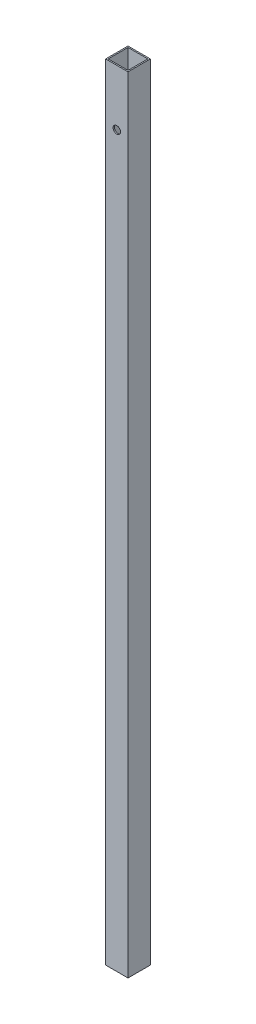
ISO-10303-21;
HEADER;
FILE_DESCRIPTION(('STEP AP214'),'2;1');
FILE_NAME('part.step','',(''),(''),'','','');
FILE_SCHEMA(('AUTOMOTIVE_DESIGN { 1 0 10303 214 1 1 1 1 }'));
ENDSEC;
DATA;
#1=APPLICATION_CONTEXT('core data for automotive mechanical design processes');
#2=APPLICATION_PROTOCOL_DEFINITION('international standard','automotive_design',2000,#1);
#3=PRODUCT_CONTEXT('',#1,'mechanical');
#4=PRODUCT('Part','Part','',(#3));
#5=PRODUCT_RELATED_PRODUCT_CATEGORY('part','',(#4));
#6=PRODUCT_DEFINITION_FORMATION('','',#4);
#7=PRODUCT_DEFINITION_CONTEXT('part definition',#1,'design');
#8=PRODUCT_DEFINITION('design','',#6,#7);
#9=PRODUCT_DEFINITION_SHAPE('','',#8);
#10=(LENGTH_UNIT() NAMED_UNIT(*) SI_UNIT(.MILLI.,.METRE.));
#11=(NAMED_UNIT(*) PLANE_ANGLE_UNIT() SI_UNIT($,.RADIAN.));
#12=(NAMED_UNIT(*) SI_UNIT($,.STERADIAN.) SOLID_ANGLE_UNIT());
#13=UNCERTAINTY_MEASURE_WITH_UNIT(LENGTH_MEASURE(1.E-05),#10,'distance_accuracy_value','');
#14=(GEOMETRIC_REPRESENTATION_CONTEXT(3) GLOBAL_UNCERTAINTY_ASSIGNED_CONTEXT((#13)) GLOBAL_UNIT_ASSIGNED_CONTEXT((#10,
#11,#12)) REPRESENTATION_CONTEXT('',''));
#15=CARTESIAN_POINT('',(0.,0.,0.));
#16=DIRECTION('',(0.,0.,1.));
#17=DIRECTION('',(1.,0.,0.));
#18=AXIS2_PLACEMENT_3D('',#15,#16,#17);
#19=CARTESIAN_POINT('',(0.,632.,0.));
#20=DIRECTION('',(0.,1.,0.));
#21=DIRECTION('',(0.,0.,1.));
#22=AXIS2_PLACEMENT_3D('',#19,#20,#21);
#23=PLANE('',#22);
#24=DIRECTION('',(0.,0.,-1.));
#25=VECTOR('',#24,1.);
#26=CARTESIAN_POINT('',(9.00000000000001,632.,-9.));
#27=LINE('',#26,#25);
#28=CARTESIAN_POINT('',(9.00000000000001,632.,9.00000000000001));
#29=VERTEX_POINT('',#28);
#30=CARTESIAN_POINT('',(9.00000000000001,632.,-9.));
#31=VERTEX_POINT('',#30);
#32=EDGE_CURVE('E143',#29,#31,#27,.T.);
#33=ORIENTED_EDGE('',*,*,#32,.T.);
#34=DIRECTION('',(-1.,0.,0.));
#35=VECTOR('',#34,1.);
#36=CARTESIAN_POINT('',(-9.,632.,-9.));
#37=LINE('',#36,#35);
#38=CARTESIAN_POINT('',(-9.,632.,-9.));
#39=VERTEX_POINT('',#38);
#40=EDGE_CURVE('E146',#31,#39,#37,.T.);
#41=ORIENTED_EDGE('',*,*,#40,.T.);
#42=DIRECTION('',(0.,0.,1.));
#43=VECTOR('',#42,1.);
#44=CARTESIAN_POINT('',(-9.,632.,-9.));
#45=LINE('',#44,#43);
#46=CARTESIAN_POINT('',(-8.99999999999999,632.,9.00000000000001));
#47=VERTEX_POINT('',#46);
#48=EDGE_CURVE('E149',#39,#47,#45,.T.);
#49=ORIENTED_EDGE('',*,*,#48,.T.);
#50=DIRECTION('',(1.,0.,0.));
#51=VECTOR('',#50,1.);
#52=CARTESIAN_POINT('',(-8.99999999999999,632.,9.00000000000001));
#53=LINE('',#52,#51);
#54=EDGE_CURVE('E151',#47,#29,#53,.T.);
#55=ORIENTED_EDGE('',*,*,#54,.T.);
#56=EDGE_LOOP('',(#33,#41,#49,#55));
#57=FACE_BOUND('',#56,.T.);
#58=DIRECTION('',(0.,0.,1.));
#59=VECTOR('',#58,1.);
#60=CARTESIAN_POINT('',(-8.,632.,-8.));
#61=LINE('',#60,#59);
#62=CARTESIAN_POINT('',(-8.,632.,-8.));
#63=VERTEX_POINT('',#62);
#64=CARTESIAN_POINT('',(-7.99999999999999,632.,8.00000000000001));
#65=VERTEX_POINT('',#64);
#66=EDGE_CURVE('E113',#63,#65,#61,.T.);
#67=ORIENTED_EDGE('',*,*,#66,.F.);
#68=DIRECTION('',(-1.,0.,0.));
#69=VECTOR('',#68,1.);
#70=CARTESIAN_POINT('',(-8.,632.,-8.));
#71=LINE('',#70,#69);
#72=CARTESIAN_POINT('',(8.,632.,-8.));
#73=VERTEX_POINT('',#72);
#74=EDGE_CURVE('E105',#73,#63,#71,.T.);
#75=ORIENTED_EDGE('',*,*,#74,.F.);
#76=DIRECTION('',(0.,0.,-1.));
#77=VECTOR('',#76,1.);
#78=CARTESIAN_POINT('',(8.,632.,-8.));
#79=LINE('',#78,#77);
#80=CARTESIAN_POINT('',(8.00000000000001,632.,8.00000000000001));
#81=VERTEX_POINT('',#80);
#82=EDGE_CURVE('E127',#81,#73,#79,.T.);
#83=ORIENTED_EDGE('',*,*,#82,.F.);
#84=DIRECTION('',(1.,0.,0.));
#85=VECTOR('',#84,1.);
#86=CARTESIAN_POINT('',(-7.99999999999999,632.,8.00000000000001));
#87=LINE('',#86,#85);
#88=EDGE_CURVE('E125',#65,#81,#87,.T.);
#89=ORIENTED_EDGE('',*,*,#88,.F.);
#90=EDGE_LOOP('',(#67,#75,#83,#89));
#91=FACE_BOUND('',#90,.T.);
#92=ADVANCED_FACE('F39',(#57,#91),#23,.T.);
#93=CARTESIAN_POINT('',(0.,0.,0.));
#94=DIRECTION('',(0.,1.,0.));
#95=DIRECTION('',(0.,0.,1.));
#96=AXIS2_PLACEMENT_3D('',#93,#94,#95);
#97=PLANE('',#96);
#98=DIRECTION('',(0.,0.,-1.));
#99=VECTOR('',#98,1.);
#100=CARTESIAN_POINT('',(9.00000000000001,0.,-9.));
#101=LINE('',#100,#99);
#102=CARTESIAN_POINT('',(9.00000000000001,0.,9.00000000000001));
#103=VERTEX_POINT('',#102);
#104=CARTESIAN_POINT('',(9.00000000000001,0.,-9.));
#105=VERTEX_POINT('',#104);
#106=EDGE_CURVE('E121',#103,#105,#101,.T.);
#107=ORIENTED_EDGE('',*,*,#106,.F.);
#108=DIRECTION('',(1.,0.,0.));
#109=VECTOR('',#108,1.);
#110=CARTESIAN_POINT('',(-8.99999999999999,0.,9.00000000000001));
#111=LINE('',#110,#109);
#112=CARTESIAN_POINT('',(-8.99999999999999,0.,9.00000000000001));
#113=VERTEX_POINT('',#112);
#114=EDGE_CURVE('E147',#113,#103,#111,.T.);
#115=ORIENTED_EDGE('',*,*,#114,.F.);
#116=DIRECTION('',(0.,0.,1.));
#117=VECTOR('',#116,1.);
#118=CARTESIAN_POINT('',(-9.,0.,-9.));
#119=LINE('',#118,#117);
#120=CARTESIAN_POINT('',(-9.,0.,-9.));
#121=VERTEX_POINT('',#120);
#122=EDGE_CURVE('E158',#121,#113,#119,.T.);
#123=ORIENTED_EDGE('',*,*,#122,.F.);
#124=DIRECTION('',(-1.,0.,0.));
#125=VECTOR('',#124,1.);
#126=CARTESIAN_POINT('',(-9.,0.,-9.));
#127=LINE('',#126,#125);
#128=EDGE_CURVE('E156',#105,#121,#127,.T.);
#129=ORIENTED_EDGE('',*,*,#128,.F.);
#130=EDGE_LOOP('',(#107,#115,#123,#129));
#131=FACE_BOUND('',#130,.T.);
#132=DIRECTION('',(-1.,0.,0.));
#133=VECTOR('',#132,1.);
#134=CARTESIAN_POINT('',(-8.,0.,-8.));
#135=LINE('',#134,#133);
#136=CARTESIAN_POINT('',(8.,0.,-8.));
#137=VERTEX_POINT('',#136);
#138=CARTESIAN_POINT('',(-8.,0.,-8.));
#139=VERTEX_POINT('',#138);
#140=EDGE_CURVE('E63',#137,#139,#135,.T.);
#141=ORIENTED_EDGE('',*,*,#140,.T.);
#142=DIRECTION('',(0.,0.,1.));
#143=VECTOR('',#142,1.);
#144=CARTESIAN_POINT('',(-8.,0.,-8.));
#145=LINE('',#144,#143);
#146=CARTESIAN_POINT('',(-7.99999999999999,0.,8.00000000000001));
#147=VERTEX_POINT('',#146);
#148=EDGE_CURVE('E120',#139,#147,#145,.T.);
#149=ORIENTED_EDGE('',*,*,#148,.T.);
#150=DIRECTION('',(1.,0.,0.));
#151=VECTOR('',#150,1.);
#152=CARTESIAN_POINT('',(-7.99999999999999,0.,8.00000000000001));
#153=LINE('',#152,#151);
#154=CARTESIAN_POINT('',(8.00000000000001,0.,8.00000000000001));
#155=VERTEX_POINT('',#154);
#156=EDGE_CURVE('E135',#147,#155,#153,.T.);
#157=ORIENTED_EDGE('',*,*,#156,.T.);
#158=DIRECTION('',(0.,0.,-1.));
#159=VECTOR('',#158,1.);
#160=CARTESIAN_POINT('',(8.,0.,-8.));
#161=LINE('',#160,#159);
#162=EDGE_CURVE('E114',#155,#137,#161,.T.);
#163=ORIENTED_EDGE('',*,*,#162,.T.);
#164=EDGE_LOOP('',(#141,#149,#157,#163));
#165=FACE_BOUND('',#164,.T.);
#166=ADVANCED_FACE('F177',(#131,#165),#97,.F.);
#167=CARTESIAN_POINT('',(9.00000000000001,632.,-9.));
#168=DIRECTION('',(-1.,0.,0.));
#169=DIRECTION('',(0.,0.,1.));
#170=AXIS2_PLACEMENT_3D('',#167,#168,#169);
#171=PLANE('',#170);
#172=ORIENTED_EDGE('',*,*,#106,.T.);
#173=DIRECTION('',(0.,-1.,0.));
#174=VECTOR('',#173,1.);
#175=CARTESIAN_POINT('',(9.00000000000001,632.,-9.));
#176=LINE('',#175,#174);
#177=EDGE_CURVE('E11',#31,#105,#176,.T.);
#178=ORIENTED_EDGE('',*,*,#177,.F.);
#179=ORIENTED_EDGE('',*,*,#32,.F.);
#180=DIRECTION('',(0.,-1.,0.));
#181=VECTOR('',#180,1.);
#182=CARTESIAN_POINT('',(9.00000000000001,632.,9.00000000000001));
#183=LINE('',#182,#181);
#184=EDGE_CURVE('E153',#29,#103,#183,.T.);
#185=ORIENTED_EDGE('',*,*,#184,.T.);
#186=EDGE_LOOP('',(#172,#178,#179,#185));
#187=FACE_BOUND('',#186,.T.);
#188=ADVANCED_FACE('F41',(#187),#171,.F.);
#189=CARTESIAN_POINT('',(-9.,632.,-9.));
#190=DIRECTION('',(0.,0.,1.));
#191=DIRECTION('',(1.,0.,0.));
#192=AXIS2_PLACEMENT_3D('',#189,#190,#191);
#193=PLANE('',#192);
#194=CARTESIAN_POINT('',(0.,587.,-9.00000000000001));
#195=DIRECTION('',(0.,0.,1.));
#196=DIRECTION('',(1.,0.,0.));
#197=AXIS2_PLACEMENT_3D('',#194,#195,#196);
#198=CIRCLE('',#197,2.99999999999999);
#199=CARTESIAN_POINT('',(2.99999999999999,587.,-9.00000000000001));
#200=VERTEX_POINT('',#199);
#201=EDGE_CURVE('E133',#200,#200,#198,.T.);
#202=ORIENTED_EDGE('',*,*,#201,.T.);
#203=EDGE_LOOP('',(#202));
#204=FACE_BOUND('',#203,.T.);
#205=ORIENTED_EDGE('',*,*,#128,.T.);
#206=DIRECTION('',(0.,-1.,0.));
#207=VECTOR('',#206,1.);
#208=CARTESIAN_POINT('',(-9.,632.,-9.));
#209=LINE('',#208,#207);
#210=EDGE_CURVE('E48',#39,#121,#209,.T.);
#211=ORIENTED_EDGE('',*,*,#210,.F.);
#212=ORIENTED_EDGE('',*,*,#40,.F.);
#213=ORIENTED_EDGE('',*,*,#177,.T.);
#214=EDGE_LOOP('',(#205,#211,#212,#213));
#215=FACE_BOUND('',#214,.T.);
#216=ADVANCED_FACE('F187',(#204,#215),#193,.F.);
#217=CARTESIAN_POINT('',(-9.,632.,-9.));
#218=DIRECTION('',(1.,0.,0.));
#219=DIRECTION('',(0.,0.,-1.));
#220=AXIS2_PLACEMENT_3D('',#217,#218,#219);
#221=PLANE('',#220);
#222=ORIENTED_EDGE('',*,*,#122,.T.);
#223=DIRECTION('',(0.,-1.,0.));
#224=VECTOR('',#223,1.);
#225=CARTESIAN_POINT('',(-8.99999999999999,632.,9.00000000000001));
#226=LINE('',#225,#224);
#227=EDGE_CURVE('E163',#47,#113,#226,.T.);
#228=ORIENTED_EDGE('',*,*,#227,.F.);
#229=ORIENTED_EDGE('',*,*,#48,.F.);
#230=ORIENTED_EDGE('',*,*,#210,.T.);
#231=EDGE_LOOP('',(#222,#228,#229,#230));
#232=FACE_BOUND('',#231,.T.);
#233=ADVANCED_FACE('F171',(#232),#221,.F.);
#234=CARTESIAN_POINT('',(-8.99999999999999,632.,9.00000000000001));
#235=DIRECTION('',(0.,0.,-1.));
#236=DIRECTION('',(-1.,0.,0.));
#237=AXIS2_PLACEMENT_3D('',#234,#235,#236);
#238=PLANE('',#237);
#239=CARTESIAN_POINT('',(0.,587.,9.00000000000001));
#240=DIRECTION('',(0.,0.,1.));
#241=DIRECTION('',(1.,0.,0.));
#242=AXIS2_PLACEMENT_3D('',#239,#240,#241);
#243=CIRCLE('',#242,2.99999999999999);
#244=CARTESIAN_POINT('',(2.99999999999999,587.,9.00000000000001));
#245=VERTEX_POINT('',#244);
#246=EDGE_CURVE('E214',#245,#245,#243,.T.);
#247=ORIENTED_EDGE('',*,*,#246,.F.);
#248=EDGE_LOOP('',(#247));
#249=FACE_BOUND('',#248,.T.);
#250=ORIENTED_EDGE('',*,*,#114,.T.);
#251=ORIENTED_EDGE('',*,*,#184,.F.);
#252=ORIENTED_EDGE('',*,*,#54,.F.);
#253=ORIENTED_EDGE('',*,*,#227,.T.);
#254=EDGE_LOOP('',(#250,#251,#252,#253));
#255=FACE_BOUND('',#254,.T.);
#256=ADVANCED_FACE('F181',(#249,#255),#238,.F.);
#257=CARTESIAN_POINT('',(-8.,632.,-8.));
#258=DIRECTION('',(0.,0.,1.));
#259=DIRECTION('',(1.,0.,0.));
#260=AXIS2_PLACEMENT_3D('',#257,#258,#259);
#261=PLANE('',#260);
#262=CARTESIAN_POINT('',(0.,587.,-8.00000000000001));
#263=DIRECTION('',(0.,0.,1.));
#264=DIRECTION('',(1.,0.,0.));
#265=AXIS2_PLACEMENT_3D('',#262,#263,#264);
#266=CIRCLE('',#265,2.99999999999999);
#267=CARTESIAN_POINT('',(2.99999999999999,587.,-8.00000000000001));
#268=VERTEX_POINT('',#267);
#269=EDGE_CURVE('E218',#268,#268,#266,.T.);
#270=ORIENTED_EDGE('',*,*,#269,.F.);
#271=EDGE_LOOP('',(#270));
#272=FACE_BOUND('',#271,.T.);
#273=ORIENTED_EDGE('',*,*,#140,.F.);
#274=DIRECTION('',(0.,-1.,0.));
#275=VECTOR('',#274,1.);
#276=CARTESIAN_POINT('',(8.,632.,-8.));
#277=LINE('',#276,#275);
#278=EDGE_CURVE('E109',#73,#137,#277,.T.);
#279=ORIENTED_EDGE('',*,*,#278,.F.);
#280=ORIENTED_EDGE('',*,*,#74,.T.);
#281=DIRECTION('',(0.,-1.,0.));
#282=VECTOR('',#281,1.);
#283=CARTESIAN_POINT('',(-8.,632.,-8.));
#284=LINE('',#283,#282);
#285=EDGE_CURVE('E108',#63,#139,#284,.T.);
#286=ORIENTED_EDGE('',*,*,#285,.T.);
#287=EDGE_LOOP('',(#273,#279,#280,#286));
#288=FACE_BOUND('',#287,.T.);
#289=ADVANCED_FACE('F107',(#272,#288),#261,.T.);
#290=CARTESIAN_POINT('',(-8.,632.,-8.));
#291=DIRECTION('',(1.,0.,0.));
#292=DIRECTION('',(0.,0.,-1.));
#293=AXIS2_PLACEMENT_3D('',#290,#291,#292);
#294=PLANE('',#293);
#295=ORIENTED_EDGE('',*,*,#148,.F.);
#296=ORIENTED_EDGE('',*,*,#285,.F.);
#297=ORIENTED_EDGE('',*,*,#66,.T.);
#298=DIRECTION('',(0.,-1.,0.));
#299=VECTOR('',#298,1.);
#300=CARTESIAN_POINT('',(-7.99999999999999,632.,8.00000000000001));
#301=LINE('',#300,#299);
#302=EDGE_CURVE('E122',#65,#147,#301,.T.);
#303=ORIENTED_EDGE('',*,*,#302,.T.);
#304=EDGE_LOOP('',(#295,#296,#297,#303));
#305=FACE_BOUND('',#304,.T.);
#306=ADVANCED_FACE('F117',(#305),#294,.T.);
#307=CARTESIAN_POINT('',(-7.99999999999999,632.,8.00000000000001));
#308=DIRECTION('',(0.,0.,-1.));
#309=DIRECTION('',(-1.,0.,0.));
#310=AXIS2_PLACEMENT_3D('',#307,#308,#309);
#311=PLANE('',#310);
#312=CARTESIAN_POINT('',(0.,587.,8.00000000000001));
#313=DIRECTION('',(0.,0.,-1.));
#314=DIRECTION('',(-1.,0.,0.));
#315=AXIS2_PLACEMENT_3D('',#312,#313,#314);
#316=CIRCLE('',#315,2.99999999999999);
#317=CARTESIAN_POINT('',(-2.99999999999999,587.,8.00000000000001));
#318=VERTEX_POINT('',#317);
#319=EDGE_CURVE('E43',#318,#318,#316,.T.);
#320=ORIENTED_EDGE('',*,*,#319,.F.);
#321=EDGE_LOOP('',(#320));
#322=FACE_BOUND('',#321,.T.);
#323=ORIENTED_EDGE('',*,*,#156,.F.);
#324=ORIENTED_EDGE('',*,*,#302,.F.);
#325=ORIENTED_EDGE('',*,*,#88,.T.);
#326=DIRECTION('',(0.,-1.,0.));
#327=VECTOR('',#326,1.);
#328=CARTESIAN_POINT('',(8.00000000000001,632.,8.00000000000001));
#329=LINE('',#328,#327);
#330=EDGE_CURVE('E55',#81,#155,#329,.T.);
#331=ORIENTED_EDGE('',*,*,#330,.T.);
#332=EDGE_LOOP('',(#323,#324,#325,#331));
#333=FACE_BOUND('',#332,.T.);
#334=ADVANCED_FACE('F235',(#322,#333),#311,.T.);
#335=CARTESIAN_POINT('',(8.,632.,-8.));
#336=DIRECTION('',(-1.,0.,0.));
#337=DIRECTION('',(0.,0.,1.));
#338=AXIS2_PLACEMENT_3D('',#335,#336,#337);
#339=PLANE('',#338);
#340=ORIENTED_EDGE('',*,*,#162,.F.);
#341=ORIENTED_EDGE('',*,*,#330,.F.);
#342=ORIENTED_EDGE('',*,*,#82,.T.);
#343=ORIENTED_EDGE('',*,*,#278,.T.);
#344=EDGE_LOOP('',(#340,#341,#342,#343));
#345=FACE_BOUND('',#344,.T.);
#346=ADVANCED_FACE('F231',(#345),#339,.T.);
#347=CARTESIAN_POINT('',(0.,587.,-984.));
#348=DIRECTION('',(0.,0.,1.));
#349=DIRECTION('',(1.,0.,0.));
#350=AXIS2_PLACEMENT_3D('',#347,#348,#349);
#351=CYLINDRICAL_SURFACE('',#350,2.99999999999999);
#352=ORIENTED_EDGE('',*,*,#319,.T.);
#353=EDGE_LOOP('',(#352));
#354=FACE_BOUND('',#353,.T.);
#355=ORIENTED_EDGE('',*,*,#246,.T.);
#356=EDGE_LOOP('',(#355));
#357=FACE_BOUND('',#356,.T.);
#358=ADVANCED_FACE('F225',(#354,#357),#351,.F.);
#359=ORIENTED_EDGE('',*,*,#269,.T.);
#360=EDGE_LOOP('',(#359));
#361=FACE_BOUND('',#360,.T.);
#362=ORIENTED_EDGE('',*,*,#201,.F.);
#363=EDGE_LOOP('',(#362));
#364=FACE_BOUND('',#363,.T.);
#365=ADVANCED_FACE('F223',(#361,#364),#351,.F.);
#366=CLOSED_SHELL('',(#92,#166,#188,#216,#233,#256,#289,#306,#334,#346,#358,#365));
#367=MANIFOLD_SOLID_BREP('B2',#366);
#368=ADVANCED_BREP_SHAPE_REPRESENTATION('',(#18,#367),#14);
#369=SHAPE_DEFINITION_REPRESENTATION(#9,#368);
ENDSEC;
END-ISO-10303-21;
